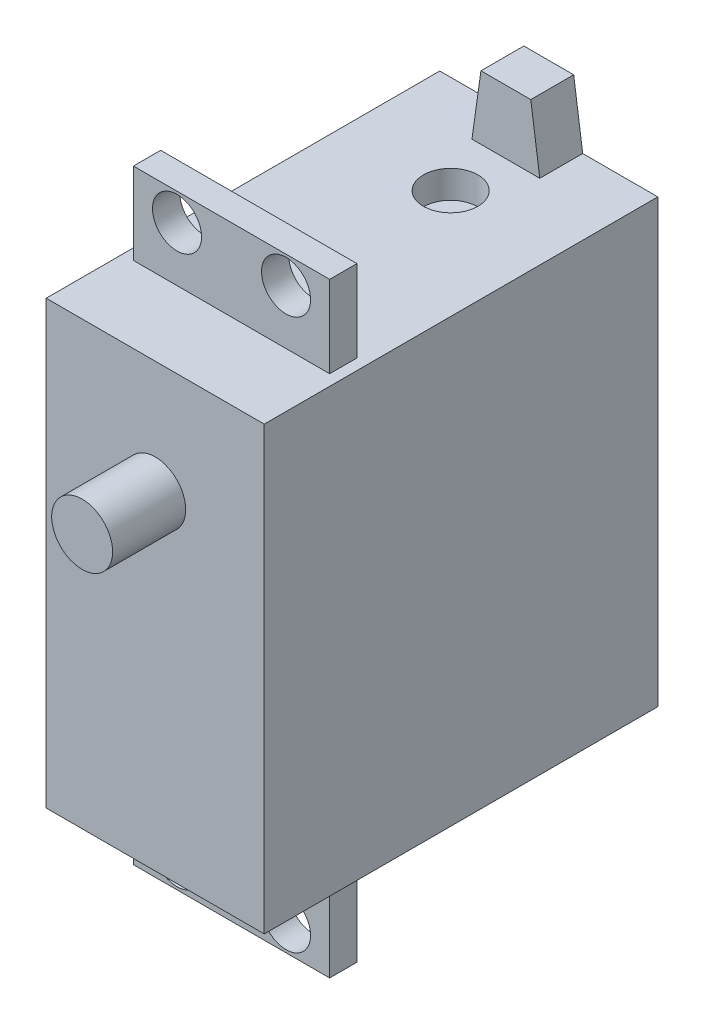
ISO-10303-21;
HEADER;
FILE_DESCRIPTION(('STEP AP214'),'2;1');
FILE_NAME('part.step','',(''),(''),'','','');
FILE_SCHEMA(('AUTOMOTIVE_DESIGN { 1 0 10303 214 1 1 1 1 }'));
ENDSEC;
DATA;
#1=APPLICATION_CONTEXT('core data for automotive mechanical design processes');
#2=APPLICATION_PROTOCOL_DEFINITION('international standard','automotive_design',2000,#1);
#3=PRODUCT_CONTEXT('',#1,'mechanical');
#4=PRODUCT('Part','Part','',(#3));
#5=PRODUCT_RELATED_PRODUCT_CATEGORY('part','',(#4));
#6=PRODUCT_DEFINITION_FORMATION('','',#4);
#7=PRODUCT_DEFINITION_CONTEXT('part definition',#1,'design');
#8=PRODUCT_DEFINITION('design','',#6,#7);
#9=PRODUCT_DEFINITION_SHAPE('','',#8);
#10=(LENGTH_UNIT() NAMED_UNIT(*) SI_UNIT(.MILLI.,.METRE.));
#11=(NAMED_UNIT(*) PLANE_ANGLE_UNIT() SI_UNIT($,.RADIAN.));
#12=(NAMED_UNIT(*) SI_UNIT($,.STERADIAN.) SOLID_ANGLE_UNIT());
#13=UNCERTAINTY_MEASURE_WITH_UNIT(LENGTH_MEASURE(1.E-05),#10,'distance_accuracy_value','');
#14=(GEOMETRIC_REPRESENTATION_CONTEXT(3) GLOBAL_UNCERTAINTY_ASSIGNED_CONTEXT((#13)) GLOBAL_UNIT_ASSIGNED_CONTEXT((#10,
#11,#12)) REPRESENTATION_CONTEXT('',''));
#15=CARTESIAN_POINT('',(0.,0.,0.));
#16=DIRECTION('',(0.,0.,1.));
#17=DIRECTION('',(1.,0.,0.));
#18=AXIS2_PLACEMENT_3D('',#15,#16,#17);
#19=CARTESIAN_POINT('',(0.,0.,9.50000005));
#20=DIRECTION('',(0.,0.,1.));
#21=DIRECTION('',(1.,0.,0.));
#22=AXIS2_PLACEMENT_3D('',#19,#20,#21);
#23=PLANE('',#22);
#24=DIRECTION('',(0.,-1.,0.));
#25=VECTOR('',#24,1.);
#26=CARTESIAN_POINT('',(0.,40.5,9.50000005));
#27=LINE('',#26,#25);
#28=CARTESIAN_POINT('',(0.,40.5,9.50000005));
#29=VERTEX_POINT('',#28);
#30=CARTESIAN_POINT('',(0.,0.,9.50000005));
#31=VERTEX_POINT('',#30);
#32=EDGE_CURVE('E280',#29,#31,#27,.T.);
#33=ORIENTED_EDGE('',*,*,#32,.T.);
#34=DIRECTION('',(1.,0.,0.));
#35=VECTOR('',#34,1.);
#36=CARTESIAN_POINT('',(0.,0.,9.50000005));
#37=LINE('',#36,#35);
#38=CARTESIAN_POINT('',(20.,0.,9.50000005));
#39=VERTEX_POINT('',#38);
#40=EDGE_CURVE('E283',#31,#39,#37,.T.);
#41=ORIENTED_EDGE('',*,*,#40,.T.);
#42=DIRECTION('',(0.,1.,0.));
#43=VECTOR('',#42,1.);
#44=CARTESIAN_POINT('',(20.,40.5,9.50000005));
#45=LINE('',#44,#43);
#46=CARTESIAN_POINT('',(20.,40.5,9.50000005));
#47=VERTEX_POINT('',#46);
#48=EDGE_CURVE('E285',#39,#47,#45,.T.);
#49=ORIENTED_EDGE('',*,*,#48,.T.);
#50=DIRECTION('',(-1.,0.,0.));
#51=VECTOR('',#50,1.);
#52=CARTESIAN_POINT('',(0.,40.5,9.50000005));
#53=LINE('',#52,#51);
#54=EDGE_CURVE('E287',#47,#29,#53,.T.);
#55=ORIENTED_EDGE('',*,*,#54,.T.);
#56=EDGE_LOOP('',(#33,#41,#49,#55));
#57=FACE_BOUND('',#56,.T.);
#58=CARTESIAN_POINT('',(10.,30.1,9.50000005));
#59=DIRECTION('',(0.,0.,1.));
#60=DIRECTION('',(1.,0.,0.));
#61=AXIS2_PLACEMENT_3D('',#58,#59,#60);
#62=CIRCLE('',#61,2.794);
#63=CARTESIAN_POINT('',(12.794,30.1,9.50000005));
#64=VERTEX_POINT('',#63);
#65=EDGE_CURVE('E183',#64,#64,#62,.T.);
#66=ORIENTED_EDGE('',*,*,#65,.F.);
#67=EDGE_LOOP('',(#66));
#68=FACE_BOUND('',#67,.T.);
#69=ADVANCED_FACE('F35',(#57,#68),#23,.T.);
#70=CARTESIAN_POINT('',(0.,40.5,9.50000005));
#71=DIRECTION('',(1.,0.,0.));
#72=DIRECTION('',(0.,1.,0.));
#73=AXIS2_PLACEMENT_3D('',#70,#71,#72);
#74=PLANE('',#73);
#75=DIRECTION('',(0.,0.,-1.));
#76=VECTOR('',#75,1.);
#77=CARTESIAN_POINT('',(0.,40.5,9.50000005));
#78=LINE('',#77,#76);
#79=CARTESIAN_POINT('',(0.,40.5,-26.60000005));
#80=VERTEX_POINT('',#79);
#81=EDGE_CURVE('E289',#29,#80,#78,.T.);
#82=ORIENTED_EDGE('',*,*,#81,.T.);
#83=DIRECTION('',(0.,1.,0.));
#84=VECTOR('',#83,1.);
#85=CARTESIAN_POINT('',(0.,40.5,-26.60000005));
#86=LINE('',#85,#84);
#87=CARTESIAN_POINT('',(0.,0.,-26.60000005));
#88=VERTEX_POINT('',#87);
#89=EDGE_CURVE('E274',#88,#80,#86,.T.);
#90=ORIENTED_EDGE('',*,*,#89,.F.);
#91=DIRECTION('',(0.,0.,-1.));
#92=VECTOR('',#91,1.);
#93=CARTESIAN_POINT('',(0.,0.,9.50000005));
#94=LINE('',#93,#92);
#95=EDGE_CURVE('E295',#31,#88,#94,.T.);
#96=ORIENTED_EDGE('',*,*,#95,.F.);
#97=ORIENTED_EDGE('',*,*,#32,.F.);
#98=EDGE_LOOP('',(#82,#90,#96,#97));
#99=FACE_BOUND('',#98,.T.);
#100=ADVANCED_FACE('F37',(#99),#74,.F.);
#101=CARTESIAN_POINT('',(0.,0.,9.50000005));
#102=DIRECTION('',(0.,1.,0.));
#103=DIRECTION('',(0.,0.,1.));
#104=AXIS2_PLACEMENT_3D('',#101,#102,#103);
#105=PLANE('',#104);
#106=DIRECTION('',(0.,0.,-1.));
#107=VECTOR('',#106,1.);
#108=CARTESIAN_POINT('',(1.,0.,2.5));
#109=LINE('',#108,#107);
#110=CARTESIAN_POINT('',(1.,0.,2.5));
#111=VERTEX_POINT('',#110);
#112=CARTESIAN_POINT('',(1.,0.,0.));
#113=VERTEX_POINT('',#112);
#114=EDGE_CURVE('E252',#111,#113,#109,.T.);
#115=ORIENTED_EDGE('',*,*,#114,.F.);
#116=DIRECTION('',(1.,0.,0.));
#117=VECTOR('',#116,1.);
#118=CARTESIAN_POINT('',(0.,0.,2.5));
#119=LINE('',#118,#117);
#120=CARTESIAN_POINT('',(19.,0.,2.5));
#121=VERTEX_POINT('',#120);
#122=EDGE_CURVE('E266',#111,#121,#119,.T.);
#123=ORIENTED_EDGE('',*,*,#122,.T.);
#124=DIRECTION('',(0.,0.,-1.));
#125=VECTOR('',#124,1.);
#126=CARTESIAN_POINT('',(19.,0.,2.5));
#127=LINE('',#126,#125);
#128=CARTESIAN_POINT('',(19.,0.,0.));
#129=VERTEX_POINT('',#128);
#130=EDGE_CURVE('E232',#121,#129,#127,.T.);
#131=ORIENTED_EDGE('',*,*,#130,.T.);
#132=DIRECTION('',(1.,0.,0.));
#133=VECTOR('',#132,1.);
#134=CARTESIAN_POINT('',(0.,0.,0.));
#135=LINE('',#134,#133);
#136=EDGE_CURVE('E58',#113,#129,#135,.T.);
#137=ORIENTED_EDGE('',*,*,#136,.F.);
#138=EDGE_LOOP('',(#115,#123,#131,#137));
#139=FACE_BOUND('',#138,.T.);
#140=ORIENTED_EDGE('',*,*,#95,.T.);
#141=DIRECTION('',(-1.,0.,0.));
#142=VECTOR('',#141,1.);
#143=CARTESIAN_POINT('',(20.,0.,-26.60000005));
#144=LINE('',#143,#142);
#145=CARTESIAN_POINT('',(20.,0.,-26.60000005));
#146=VERTEX_POINT('',#145);
#147=EDGE_CURVE('E271',#146,#88,#144,.T.);
#148=ORIENTED_EDGE('',*,*,#147,.F.);
#149=DIRECTION('',(0.,0.,-1.));
#150=VECTOR('',#149,1.);
#151=CARTESIAN_POINT('',(20.,0.,9.50000005));
#152=LINE('',#151,#150);
#153=EDGE_CURVE('E293',#39,#146,#152,.T.);
#154=ORIENTED_EDGE('',*,*,#153,.F.);
#155=ORIENTED_EDGE('',*,*,#40,.F.);
#156=EDGE_LOOP('',(#140,#148,#154,#155));
#157=FACE_BOUND('',#156,.T.);
#158=ADVANCED_FACE('F339',(#139,#157),#105,.F.);
#159=CARTESIAN_POINT('',(20.,40.5,9.50000005));
#160=DIRECTION('',(-1.,0.,0.));
#161=DIRECTION('',(0.,0.,1.));
#162=AXIS2_PLACEMENT_3D('',#159,#160,#161);
#163=PLANE('',#162);
#164=ORIENTED_EDGE('',*,*,#153,.T.);
#165=DIRECTION('',(0.,-1.,0.));
#166=VECTOR('',#165,1.);
#167=CARTESIAN_POINT('',(20.,40.5,-26.60000005));
#168=LINE('',#167,#166);
#169=CARTESIAN_POINT('',(20.,40.5,-26.60000005));
#170=VERTEX_POINT('',#169);
#171=EDGE_CURVE('E268',#170,#146,#168,.T.);
#172=ORIENTED_EDGE('',*,*,#171,.F.);
#173=DIRECTION('',(0.,0.,-1.));
#174=VECTOR('',#173,1.);
#175=CARTESIAN_POINT('',(20.,40.5,9.50000005));
#176=LINE('',#175,#174);
#177=EDGE_CURVE('E291',#47,#170,#176,.T.);
#178=ORIENTED_EDGE('',*,*,#177,.F.);
#179=ORIENTED_EDGE('',*,*,#48,.F.);
#180=EDGE_LOOP('',(#164,#172,#178,#179));
#181=FACE_BOUND('',#180,.T.);
#182=ADVANCED_FACE('F348',(#181),#163,.F.);
#183=CARTESIAN_POINT('',(0.,40.5,9.50000005));
#184=DIRECTION('',(0.,-1.,0.));
#185=DIRECTION('',(1.,0.,0.));
#186=AXIS2_PLACEMENT_3D('',#183,#184,#185);
#187=PLANE('',#186);
#188=DIRECTION('',(1.,0.,0.));
#189=VECTOR('',#188,1.);
#190=CARTESIAN_POINT('',(20.,40.5,-26.60000005));
#191=LINE('',#190,#189);
#192=CARTESIAN_POINT('',(13.1115,40.5,-26.60000005));
#193=VERTEX_POINT('',#192);
#194=EDGE_CURVE('E171',#193,#170,#191,.T.);
#195=ORIENTED_EDGE('',*,*,#194,.F.);
#196=DIRECTION('',(0.,0.,-1.));
#197=VECTOR('',#196,1.);
#198=CARTESIAN_POINT('',(13.1115,40.5,-22.66300005));
#199=LINE('',#198,#197);
#200=CARTESIAN_POINT('',(13.1115,40.5,-22.66300005));
#201=VERTEX_POINT('',#200);
#202=EDGE_CURVE('E163',#201,#193,#199,.T.);
#203=ORIENTED_EDGE('',*,*,#202,.F.);
#204=DIRECTION('',(-1.,0.,0.));
#205=VECTOR('',#204,1.);
#206=CARTESIAN_POINT('',(13.1115,40.5,-22.66300005));
#207=LINE('',#206,#205);
#208=CARTESIAN_POINT('',(6.8885,40.5,-22.66300005));
#209=VERTEX_POINT('',#208);
#210=EDGE_CURVE('E149',#201,#209,#207,.T.);
#211=ORIENTED_EDGE('',*,*,#210,.T.);
#212=DIRECTION('',(0.,0.,-1.));
#213=VECTOR('',#212,1.);
#214=CARTESIAN_POINT('',(6.8885,40.5,-22.66300005));
#215=LINE('',#214,#213);
#216=CARTESIAN_POINT('',(6.8885,40.5,-26.60000005));
#217=VERTEX_POINT('',#216);
#218=EDGE_CURVE('E172',#209,#217,#215,.T.);
#219=ORIENTED_EDGE('',*,*,#218,.T.);
#220=EDGE_CURVE('E277',#80,#217,#191,.T.);
#221=ORIENTED_EDGE('',*,*,#220,.F.);
#222=ORIENTED_EDGE('',*,*,#81,.F.);
#223=ORIENTED_EDGE('',*,*,#54,.F.);
#224=ORIENTED_EDGE('',*,*,#177,.T.);
#225=EDGE_LOOP('',(#195,#203,#211,#219,#221,#222,#223,#224));
#226=FACE_BOUND('',#225,.T.);
#227=CARTESIAN_POINT('',(10.,40.5,-17.60000005));
#228=DIRECTION('',(0.,1.,0.));
#229=DIRECTION('',(-1.,0.,0.));
#230=AXIS2_PLACEMENT_3D('',#227,#228,#229);
#231=CIRCLE('',#230,2.5);
#232=CARTESIAN_POINT('',(7.5,40.5,-17.60000005));
#233=VERTEX_POINT('',#232);
#234=EDGE_CURVE('E184',#233,#233,#231,.T.);
#235=ORIENTED_EDGE('',*,*,#234,.F.);
#236=EDGE_LOOP('',(#235));
#237=FACE_BOUND('',#236,.T.);
#238=DIRECTION('',(0.,0.,-1.));
#239=VECTOR('',#238,1.);
#240=CARTESIAN_POINT('',(19.,40.5,2.5));
#241=LINE('',#240,#239);
#242=CARTESIAN_POINT('',(19.,40.5,2.5));
#243=VERTEX_POINT('',#242);
#244=CARTESIAN_POINT('',(19.,40.5,0.));
#245=VERTEX_POINT('',#244);
#246=EDGE_CURVE('E262',#243,#245,#241,.T.);
#247=ORIENTED_EDGE('',*,*,#246,.F.);
#248=DIRECTION('',(-1.,0.,0.));
#249=VECTOR('',#248,1.);
#250=CARTESIAN_POINT('',(0.,40.5,2.5));
#251=LINE('',#250,#249);
#252=CARTESIAN_POINT('',(0.999999999999999,40.5,2.5));
#253=VERTEX_POINT('',#252);
#254=EDGE_CURVE('E11',#243,#253,#251,.T.);
#255=ORIENTED_EDGE('',*,*,#254,.T.);
#256=DIRECTION('',(0.,0.,-1.));
#257=VECTOR('',#256,1.);
#258=CARTESIAN_POINT('',(0.999999999999999,40.5,2.5));
#259=LINE('',#258,#257);
#260=CARTESIAN_POINT('',(0.999999999999999,40.5,0.));
#261=VERTEX_POINT('',#260);
#262=EDGE_CURVE('E254',#253,#261,#259,.T.);
#263=ORIENTED_EDGE('',*,*,#262,.T.);
#264=DIRECTION('',(-1.,0.,0.));
#265=VECTOR('',#264,1.);
#266=CARTESIAN_POINT('',(0.,40.5,0.));
#267=LINE('',#266,#265);
#268=EDGE_CURVE('E43',#245,#261,#267,.T.);
#269=ORIENTED_EDGE('',*,*,#268,.F.);
#270=EDGE_LOOP('',(#247,#255,#263,#269));
#271=FACE_BOUND('',#270,.T.);
#272=ADVANCED_FACE('F168',(#226,#237,#271),#187,.F.);
#273=CARTESIAN_POINT('',(0.,0.,-26.60000005));
#274=DIRECTION('',(0.,0.,-1.));
#275=DIRECTION('',(-1.,0.,0.));
#276=AXIS2_PLACEMENT_3D('',#273,#274,#275);
#277=PLANE('',#276);
#278=ORIENTED_EDGE('',*,*,#171,.T.);
#279=ORIENTED_EDGE('',*,*,#147,.T.);
#280=ORIENTED_EDGE('',*,*,#89,.T.);
#281=ORIENTED_EDGE('',*,*,#220,.T.);
#282=DIRECTION('',(0.139914421726849,0.990163599913086,0.));
#283=VECTOR('',#282,1.);
#284=CARTESIAN_POINT('',(6.8885,40.5,-26.60000005));
#285=LINE('',#284,#283);
#286=CARTESIAN_POINT('',(7.714,46.342,-26.60000005));
#287=VERTEX_POINT('',#286);
#288=EDGE_CURVE('E366',#217,#287,#285,.T.);
#289=ORIENTED_EDGE('',*,*,#288,.T.);
#290=DIRECTION('',(1.,0.,0.));
#291=VECTOR('',#290,1.);
#292=CARTESIAN_POINT('',(12.286,46.342,-26.60000005));
#293=LINE('',#292,#291);
#294=CARTESIAN_POINT('',(12.286,46.342,-26.60000005));
#295=VERTEX_POINT('',#294);
#296=EDGE_CURVE('E166',#287,#295,#293,.T.);
#297=ORIENTED_EDGE('',*,*,#296,.T.);
#298=DIRECTION('',(0.139914421726849,-0.990163599913086,0.));
#299=VECTOR('',#298,1.);
#300=CARTESIAN_POINT('',(13.1115,40.5,-26.60000005));
#301=LINE('',#300,#299);
#302=EDGE_CURVE('E50',#295,#193,#301,.T.);
#303=ORIENTED_EDGE('',*,*,#302,.T.);
#304=ORIENTED_EDGE('',*,*,#194,.T.);
#305=EDGE_LOOP('',(#278,#279,#280,#281,#289,#297,#303,#304));
#306=FACE_BOUND('',#305,.T.);
#307=ADVANCED_FACE('F344',(#306),#277,.T.);
#308=CARTESIAN_POINT('',(5.,45.5,2.5));
#309=DIRECTION('',(0.,0.,-1.));
#310=DIRECTION('',(-1.,0.,0.));
#311=AXIS2_PLACEMENT_3D('',#308,#309,#310);
#312=CYLINDRICAL_SURFACE('',#311,2.25);
#313=CARTESIAN_POINT('',(5.,45.5,2.5));
#314=DIRECTION('',(0.,0.,1.));
#315=DIRECTION('',(1.,0.,0.));
#316=AXIS2_PLACEMENT_3D('',#313,#314,#315);
#317=CIRCLE('',#316,2.25);
#318=CARTESIAN_POINT('',(7.25,45.5,2.5));
#319=VERTEX_POINT('',#318);
#320=EDGE_CURVE('E199',#319,#319,#317,.T.);
#321=ORIENTED_EDGE('',*,*,#320,.T.);
#322=EDGE_LOOP('',(#321));
#323=FACE_BOUND('',#322,.T.);
#324=CARTESIAN_POINT('',(5.,45.5,0.));
#325=DIRECTION('',(0.,0.,1.));
#326=DIRECTION('',(1.,0.,0.));
#327=AXIS2_PLACEMENT_3D('',#324,#325,#326);
#328=CIRCLE('',#327,2.25);
#329=CARTESIAN_POINT('',(7.25,45.5,0.));
#330=VERTEX_POINT('',#329);
#331=EDGE_CURVE('E196',#330,#330,#328,.T.);
#332=ORIENTED_EDGE('',*,*,#331,.F.);
#333=EDGE_LOOP('',(#332));
#334=FACE_BOUND('',#333,.T.);
#335=ADVANCED_FACE('F408',(#323,#334),#312,.F.);
#336=CARTESIAN_POINT('',(15.,45.5,2.5));
#337=DIRECTION('',(0.,0.,-1.));
#338=DIRECTION('',(-1.,0.,0.));
#339=AXIS2_PLACEMENT_3D('',#336,#337,#338);
#340=CYLINDRICAL_SURFACE('',#339,2.25);
#341=CARTESIAN_POINT('',(15.,45.5,2.5));
#342=DIRECTION('',(0.,0.,1.));
#343=DIRECTION('',(1.,0.,0.));
#344=AXIS2_PLACEMENT_3D('',#341,#342,#343);
#345=CIRCLE('',#344,2.25);
#346=CARTESIAN_POINT('',(17.25,45.5,2.5));
#347=VERTEX_POINT('',#346);
#348=EDGE_CURVE('E193',#347,#347,#345,.T.);
#349=ORIENTED_EDGE('',*,*,#348,.T.);
#350=EDGE_LOOP('',(#349));
#351=FACE_BOUND('',#350,.T.);
#352=CARTESIAN_POINT('',(15.,45.5,0.));
#353=DIRECTION('',(0.,0.,1.));
#354=DIRECTION('',(1.,0.,0.));
#355=AXIS2_PLACEMENT_3D('',#352,#353,#354);
#356=CIRCLE('',#355,2.25);
#357=CARTESIAN_POINT('',(17.25,45.5,0.));
#358=VERTEX_POINT('',#357);
#359=EDGE_CURVE('E190',#358,#358,#356,.T.);
#360=ORIENTED_EDGE('',*,*,#359,.F.);
#361=EDGE_LOOP('',(#360));
#362=FACE_BOUND('',#361,.T.);
#363=ADVANCED_FACE('F405',(#351,#362),#340,.F.);
#364=CARTESIAN_POINT('',(0.999999999999997,48.,2.5));
#365=DIRECTION('',(0.,-1.,0.));
#366=DIRECTION('',(1.,0.,0.));
#367=AXIS2_PLACEMENT_3D('',#364,#365,#366);
#368=PLANE('',#367);
#369=DIRECTION('',(-1.,0.,0.));
#370=VECTOR('',#369,1.);
#371=CARTESIAN_POINT('',(0.999999999999997,48.,0.));
#372=LINE('',#371,#370);
#373=CARTESIAN_POINT('',(19.,48.,0.));
#374=VERTEX_POINT('',#373);
#375=CARTESIAN_POINT('',(0.999999999999997,48.,0.));
#376=VERTEX_POINT('',#375);
#377=EDGE_CURVE('E234',#374,#376,#372,.T.);
#378=ORIENTED_EDGE('',*,*,#377,.T.);
#379=DIRECTION('',(0.,0.,-1.));
#380=VECTOR('',#379,1.);
#381=CARTESIAN_POINT('',(0.999999999999997,48.,2.5));
#382=LINE('',#381,#380);
#383=CARTESIAN_POINT('',(0.999999999999997,48.,2.5));
#384=VERTEX_POINT('',#383);
#385=EDGE_CURVE('E256',#384,#376,#382,.T.);
#386=ORIENTED_EDGE('',*,*,#385,.F.);
#387=DIRECTION('',(-1.,0.,0.));
#388=VECTOR('',#387,1.);
#389=CARTESIAN_POINT('',(0.999999999999997,48.,2.5));
#390=LINE('',#389,#388);
#391=CARTESIAN_POINT('',(19.,48.,2.5));
#392=VERTEX_POINT('',#391);
#393=EDGE_CURVE('E219',#392,#384,#390,.T.);
#394=ORIENTED_EDGE('',*,*,#393,.F.);
#395=DIRECTION('',(0.,0.,-1.));
#396=VECTOR('',#395,1.);
#397=CARTESIAN_POINT('',(19.,48.,2.5));
#398=LINE('',#397,#396);
#399=EDGE_CURVE('E259',#392,#374,#398,.T.);
#400=ORIENTED_EDGE('',*,*,#399,.T.);
#401=EDGE_LOOP('',(#378,#386,#394,#400));
#402=FACE_BOUND('',#401,.T.);
#403=ADVANCED_FACE('F310',(#402),#368,.F.);
#404=CARTESIAN_POINT('',(0.999999999999997,48.,2.5));
#405=DIRECTION('',(1.,0.,0.));
#406=DIRECTION('',(0.,1.,0.));
#407=AXIS2_PLACEMENT_3D('',#404,#405,#406);
#408=PLANE('',#407);
#409=DIRECTION('',(0.,-1.,0.));
#410=VECTOR('',#409,1.);
#411=CARTESIAN_POINT('',(0.999999999999997,48.,0.));
#412=LINE('',#411,#410);
#413=EDGE_CURVE('E236',#376,#261,#412,.T.);
#414=ORIENTED_EDGE('',*,*,#413,.T.);
#415=ORIENTED_EDGE('',*,*,#262,.F.);
#416=DIRECTION('',(0.,-1.,0.));
#417=VECTOR('',#416,1.);
#418=CARTESIAN_POINT('',(0.999999999999997,48.,2.5));
#419=LINE('',#418,#417);
#420=EDGE_CURVE('E222',#384,#253,#419,.T.);
#421=ORIENTED_EDGE('',*,*,#420,.F.);
#422=ORIENTED_EDGE('',*,*,#385,.T.);
#423=EDGE_LOOP('',(#414,#415,#421,#422));
#424=FACE_BOUND('',#423,.T.);
#425=ADVANCED_FACE('F305',(#424),#408,.F.);
#426=CARTESIAN_POINT('',(19.,48.,2.5));
#427=DIRECTION('',(-1.,0.,0.));
#428=DIRECTION('',(0.,-1.,0.));
#429=AXIS2_PLACEMENT_3D('',#426,#427,#428);
#430=PLANE('',#429);
#431=DIRECTION('',(0.,1.,0.));
#432=VECTOR('',#431,1.);
#433=CARTESIAN_POINT('',(19.,48.,0.));
#434=LINE('',#433,#432);
#435=EDGE_CURVE('E214',#245,#374,#434,.T.);
#436=ORIENTED_EDGE('',*,*,#435,.T.);
#437=ORIENTED_EDGE('',*,*,#399,.F.);
#438=DIRECTION('',(0.,1.,0.));
#439=VECTOR('',#438,1.);
#440=CARTESIAN_POINT('',(19.,48.,2.5));
#441=LINE('',#440,#439);
#442=EDGE_CURVE('E217',#243,#392,#441,.T.);
#443=ORIENTED_EDGE('',*,*,#442,.F.);
#444=ORIENTED_EDGE('',*,*,#246,.T.);
#445=EDGE_LOOP('',(#436,#437,#443,#444));
#446=FACE_BOUND('',#445,.T.);
#447=ADVANCED_FACE('F314',(#446),#430,.F.);
#448=CARTESIAN_POINT('',(0.,0.,0.));
#449=DIRECTION('',(0.,0.,1.));
#450=DIRECTION('',(1.,0.,0.));
#451=AXIS2_PLACEMENT_3D('',#448,#449,#450);
#452=PLANE('',#451);
#453=ORIENTED_EDGE('',*,*,#359,.T.);
#454=EDGE_LOOP('',(#453));
#455=FACE_BOUND('',#454,.T.);
#456=ORIENTED_EDGE('',*,*,#331,.T.);
#457=EDGE_LOOP('',(#456));
#458=FACE_BOUND('',#457,.T.);
#459=ORIENTED_EDGE('',*,*,#435,.F.);
#460=ORIENTED_EDGE('',*,*,#268,.T.);
#461=ORIENTED_EDGE('',*,*,#413,.F.);
#462=ORIENTED_EDGE('',*,*,#377,.F.);
#463=EDGE_LOOP('',(#459,#460,#461,#462));
#464=FACE_BOUND('',#463,.T.);
#465=ADVANCED_FACE('F300',(#455,#458,#464),#452,.F.);
#466=CARTESIAN_POINT('',(0.,0.,2.5));
#467=DIRECTION('',(0.,0.,1.));
#468=DIRECTION('',(1.,0.,0.));
#469=AXIS2_PLACEMENT_3D('',#466,#467,#468);
#470=PLANE('',#469);
#471=ORIENTED_EDGE('',*,*,#348,.F.);
#472=EDGE_LOOP('',(#471));
#473=FACE_BOUND('',#472,.T.);
#474=ORIENTED_EDGE('',*,*,#320,.F.);
#475=EDGE_LOOP('',(#474));
#476=FACE_BOUND('',#475,.T.);
#477=ORIENTED_EDGE('',*,*,#254,.F.);
#478=ORIENTED_EDGE('',*,*,#442,.T.);
#479=ORIENTED_EDGE('',*,*,#393,.T.);
#480=ORIENTED_EDGE('',*,*,#420,.T.);
#481=EDGE_LOOP('',(#477,#478,#479,#480));
#482=FACE_BOUND('',#481,.T.);
#483=ADVANCED_FACE('F317',(#473,#476,#482),#470,.T.);
#484=CARTESIAN_POINT('',(15.,-5.,2.5));
#485=DIRECTION('',(0.,0.,1.));
#486=DIRECTION('',(1.,0.,0.));
#487=AXIS2_PLACEMENT_3D('',#484,#485,#486);
#488=CIRCLE('',#487,2.25);
#489=CARTESIAN_POINT('',(17.25,-5.,2.5));
#490=VERTEX_POINT('',#489);
#491=EDGE_CURVE('E205',#490,#490,#488,.T.);
#492=ORIENTED_EDGE('',*,*,#491,.F.);
#493=EDGE_LOOP('',(#492));
#494=FACE_BOUND('',#493,.T.);
#495=CARTESIAN_POINT('',(5.,-5.,2.5));
#496=DIRECTION('',(0.,0.,1.));
#497=DIRECTION('',(1.,0.,0.));
#498=AXIS2_PLACEMENT_3D('',#495,#496,#497);
#499=CIRCLE('',#498,2.25);
#500=CARTESIAN_POINT('',(7.25,-5.,2.5));
#501=VERTEX_POINT('',#500);
#502=EDGE_CURVE('E211',#501,#501,#499,.T.);
#503=ORIENTED_EDGE('',*,*,#502,.F.);
#504=EDGE_LOOP('',(#503));
#505=FACE_BOUND('',#504,.T.);
#506=ORIENTED_EDGE('',*,*,#122,.F.);
#507=DIRECTION('',(0.,-1.,0.));
#508=VECTOR('',#507,1.);
#509=CARTESIAN_POINT('',(1.,0.,2.5));
#510=LINE('',#509,#508);
#511=CARTESIAN_POINT('',(1.00000000000002,-7.5,2.5));
#512=VERTEX_POINT('',#511);
#513=EDGE_CURVE('E225',#111,#512,#510,.T.);
#514=ORIENTED_EDGE('',*,*,#513,.T.);
#515=DIRECTION('',(1.,0.,0.));
#516=VECTOR('',#515,1.);
#517=CARTESIAN_POINT('',(1.00000000000002,-7.5,2.5));
#518=LINE('',#517,#516);
#519=CARTESIAN_POINT('',(19.,-7.5,2.5));
#520=VERTEX_POINT('',#519);
#521=EDGE_CURVE('E227',#512,#520,#518,.T.);
#522=ORIENTED_EDGE('',*,*,#521,.T.);
#523=DIRECTION('',(0.,1.,0.));
#524=VECTOR('',#523,1.);
#525=CARTESIAN_POINT('',(19.,0.,2.5));
#526=LINE('',#525,#524);
#527=EDGE_CURVE('E229',#520,#121,#526,.T.);
#528=ORIENTED_EDGE('',*,*,#527,.T.);
#529=EDGE_LOOP('',(#506,#514,#522,#528));
#530=FACE_BOUND('',#529,.T.);
#531=ADVANCED_FACE('F319',(#494,#505,#530),#470,.T.);
#532=CARTESIAN_POINT('',(15.,-5.,0.));
#533=DIRECTION('',(0.,0.,1.));
#534=DIRECTION('',(1.,0.,0.));
#535=AXIS2_PLACEMENT_3D('',#532,#533,#534);
#536=CIRCLE('',#535,2.25);
#537=CARTESIAN_POINT('',(17.25,-5.,0.));
#538=VERTEX_POINT('',#537);
#539=EDGE_CURVE('E202',#538,#538,#536,.T.);
#540=ORIENTED_EDGE('',*,*,#539,.T.);
#541=EDGE_LOOP('',(#540));
#542=FACE_BOUND('',#541,.T.);
#543=CARTESIAN_POINT('',(5.,-5.,0.));
#544=DIRECTION('',(0.,0.,1.));
#545=DIRECTION('',(1.,0.,0.));
#546=AXIS2_PLACEMENT_3D('',#543,#544,#545);
#547=CIRCLE('',#546,2.25);
#548=CARTESIAN_POINT('',(7.25,-5.,0.));
#549=VERTEX_POINT('',#548);
#550=EDGE_CURVE('E208',#549,#549,#547,.T.);
#551=ORIENTED_EDGE('',*,*,#550,.T.);
#552=EDGE_LOOP('',(#551));
#553=FACE_BOUND('',#552,.T.);
#554=DIRECTION('',(0.,-1.,0.));
#555=VECTOR('',#554,1.);
#556=CARTESIAN_POINT('',(1.,0.,0.));
#557=LINE('',#556,#555);
#558=CARTESIAN_POINT('',(1.00000000000002,-7.5,0.));
#559=VERTEX_POINT('',#558);
#560=EDGE_CURVE('E239',#113,#559,#557,.T.);
#561=ORIENTED_EDGE('',*,*,#560,.F.);
#562=ORIENTED_EDGE('',*,*,#136,.T.);
#563=DIRECTION('',(0.,1.,0.));
#564=VECTOR('',#563,1.);
#565=CARTESIAN_POINT('',(19.,0.,0.));
#566=LINE('',#565,#564);
#567=CARTESIAN_POINT('',(19.,-7.5,0.));
#568=VERTEX_POINT('',#567);
#569=EDGE_CURVE('E220',#568,#129,#566,.T.);
#570=ORIENTED_EDGE('',*,*,#569,.F.);
#571=DIRECTION('',(1.,0.,0.));
#572=VECTOR('',#571,1.);
#573=CARTESIAN_POINT('',(1.00000000000002,-7.5,0.));
#574=LINE('',#573,#572);
#575=EDGE_CURVE('E241',#559,#568,#574,.T.);
#576=ORIENTED_EDGE('',*,*,#575,.F.);
#577=EDGE_LOOP('',(#561,#562,#570,#576));
#578=FACE_BOUND('',#577,.T.);
#579=ADVANCED_FACE('F326',(#542,#553,#578),#452,.F.);
#580=CARTESIAN_POINT('',(1.,0.,2.5));
#581=DIRECTION('',(1.,0.,0.));
#582=DIRECTION('',(0.,1.,0.));
#583=AXIS2_PLACEMENT_3D('',#580,#581,#582);
#584=PLANE('',#583);
#585=ORIENTED_EDGE('',*,*,#560,.T.);
#586=DIRECTION('',(0.,0.,-1.));
#587=VECTOR('',#586,1.);
#588=CARTESIAN_POINT('',(1.00000000000002,-7.5,2.5));
#589=LINE('',#588,#587);
#590=EDGE_CURVE('E249',#512,#559,#589,.T.);
#591=ORIENTED_EDGE('',*,*,#590,.F.);
#592=ORIENTED_EDGE('',*,*,#513,.F.);
#593=ORIENTED_EDGE('',*,*,#114,.T.);
#594=EDGE_LOOP('',(#585,#591,#592,#593));
#595=FACE_BOUND('',#594,.T.);
#596=ADVANCED_FACE('F431',(#595),#584,.F.);
#597=CARTESIAN_POINT('',(1.00000000000002,-7.5,2.5));
#598=DIRECTION('',(0.,1.,0.));
#599=DIRECTION('',(-1.,0.,0.));
#600=AXIS2_PLACEMENT_3D('',#597,#598,#599);
#601=PLANE('',#600);
#602=ORIENTED_EDGE('',*,*,#575,.T.);
#603=DIRECTION('',(0.,0.,-1.));
#604=VECTOR('',#603,1.);
#605=CARTESIAN_POINT('',(19.,-7.5,2.5));
#606=LINE('',#605,#604);
#607=EDGE_CURVE('E246',#520,#568,#606,.T.);
#608=ORIENTED_EDGE('',*,*,#607,.F.);
#609=ORIENTED_EDGE('',*,*,#521,.F.);
#610=ORIENTED_EDGE('',*,*,#590,.T.);
#611=EDGE_LOOP('',(#602,#608,#609,#610));
#612=FACE_BOUND('',#611,.T.);
#613=ADVANCED_FACE('F422',(#612),#601,.F.);
#614=CARTESIAN_POINT('',(19.,0.,2.5));
#615=DIRECTION('',(-1.,0.,0.));
#616=DIRECTION('',(0.,-1.,0.));
#617=AXIS2_PLACEMENT_3D('',#614,#615,#616);
#618=PLANE('',#617);
#619=ORIENTED_EDGE('',*,*,#569,.T.);
#620=ORIENTED_EDGE('',*,*,#130,.F.);
#621=ORIENTED_EDGE('',*,*,#527,.F.);
#622=ORIENTED_EDGE('',*,*,#607,.T.);
#623=EDGE_LOOP('',(#619,#620,#621,#622));
#624=FACE_BOUND('',#623,.T.);
#625=ADVANCED_FACE('F417',(#624),#618,.F.);
#626=CARTESIAN_POINT('',(5.,-5.,2.5));
#627=DIRECTION('',(0.,0.,-1.));
#628=DIRECTION('',(-1.,0.,0.));
#629=AXIS2_PLACEMENT_3D('',#626,#627,#628);
#630=CYLINDRICAL_SURFACE('',#629,2.25);
#631=ORIENTED_EDGE('',*,*,#502,.T.);
#632=EDGE_LOOP('',(#631));
#633=FACE_BOUND('',#632,.T.);
#634=ORIENTED_EDGE('',*,*,#550,.F.);
#635=EDGE_LOOP('',(#634));
#636=FACE_BOUND('',#635,.T.);
#637=ADVANCED_FACE('F414',(#633,#636),#630,.F.);
#638=CARTESIAN_POINT('',(15.,-5.,2.5));
#639=DIRECTION('',(0.,0.,-1.));
#640=DIRECTION('',(-1.,0.,0.));
#641=AXIS2_PLACEMENT_3D('',#638,#639,#640);
#642=CYLINDRICAL_SURFACE('',#641,2.25);
#643=ORIENTED_EDGE('',*,*,#491,.T.);
#644=EDGE_LOOP('',(#643));
#645=FACE_BOUND('',#644,.T.);
#646=ORIENTED_EDGE('',*,*,#539,.F.);
#647=EDGE_LOOP('',(#646));
#648=FACE_BOUND('',#647,.T.);
#649=ADVANCED_FACE('F403',(#645,#648),#642,.F.);
#650=CARTESIAN_POINT('',(10.,30.1,16.202060052));
#651=DIRECTION('',(0.,0.,-1.));
#652=DIRECTION('',(-1.,0.,0.));
#653=AXIS2_PLACEMENT_3D('',#650,#651,#652);
#654=CYLINDRICAL_SURFACE('',#653,2.794);
#655=CARTESIAN_POINT('',(10.,30.1,16.202060052));
#656=DIRECTION('',(0.,0.,1.));
#657=DIRECTION('',(1.,0.,0.));
#658=AXIS2_PLACEMENT_3D('',#655,#656,#657);
#659=CIRCLE('',#658,2.794);
#660=CARTESIAN_POINT('',(12.794,30.1,16.202060052));
#661=VERTEX_POINT('',#660);
#662=EDGE_CURVE('E187',#661,#661,#659,.T.);
#663=ORIENTED_EDGE('',*,*,#662,.F.);
#664=EDGE_LOOP('',(#663));
#665=FACE_BOUND('',#664,.T.);
#666=ORIENTED_EDGE('',*,*,#65,.T.);
#667=EDGE_LOOP('',(#666));
#668=FACE_BOUND('',#667,.T.);
#669=ADVANCED_FACE('F399',(#665,#668),#654,.T.);
#670=CARTESIAN_POINT('',(10.,30.1,16.202060052));
#671=DIRECTION('',(0.,0.,1.));
#672=DIRECTION('',(1.,0.,0.));
#673=AXIS2_PLACEMENT_3D('',#670,#671,#672);
#674=PLANE('',#673);
#675=ORIENTED_EDGE('',*,*,#662,.T.);
#676=EDGE_LOOP('',(#675));
#677=FACE_BOUND('',#676,.T.);
#678=ADVANCED_FACE('F395',(#677),#674,.T.);
#679=CARTESIAN_POINT('',(10.,37.96,-17.60000005));
#680=DIRECTION('',(0.,1.,0.));
#681=DIRECTION('',(-1.,0.,0.));
#682=AXIS2_PLACEMENT_3D('',#679,#680,#681);
#683=CYLINDRICAL_SURFACE('',#682,2.5);
#684=CARTESIAN_POINT('',(10.,37.96,-17.60000005));
#685=DIRECTION('',(0.,1.,0.));
#686=DIRECTION('',(-1.,0.,0.));
#687=AXIS2_PLACEMENT_3D('',#684,#685,#686);
#688=CIRCLE('',#687,2.5);
#689=CARTESIAN_POINT('',(7.5,37.96,-17.60000005));
#690=VERTEX_POINT('',#689);
#691=EDGE_CURVE('E180',#690,#690,#688,.T.);
#692=ORIENTED_EDGE('',*,*,#691,.F.);
#693=EDGE_LOOP('',(#692));
#694=FACE_BOUND('',#693,.T.);
#695=ORIENTED_EDGE('',*,*,#234,.T.);
#696=EDGE_LOOP('',(#695));
#697=FACE_BOUND('',#696,.T.);
#698=ADVANCED_FACE('F391',(#694,#697),#683,.F.);
#699=CARTESIAN_POINT('',(10.,37.96,-17.60000005));
#700=DIRECTION('',(0.,1.,0.));
#701=DIRECTION('',(-1.,0.,0.));
#702=AXIS2_PLACEMENT_3D('',#699,#700,#701);
#703=PLANE('',#702);
#704=ORIENTED_EDGE('',*,*,#691,.T.);
#705=EDGE_LOOP('',(#704));
#706=FACE_BOUND('',#705,.T.);
#707=ADVANCED_FACE('F388',(#706),#703,.T.);
#708=CARTESIAN_POINT('',(13.1115,40.5,-22.66300005));
#709=DIRECTION('',(0.990163599913086,0.139914421726849,0.));
#710=DIRECTION('',(-0.139914421726849,0.990163599913086,0.));
#711=AXIS2_PLACEMENT_3D('',#708,#709,#710);
#712=PLANE('',#711);
#713=ORIENTED_EDGE('',*,*,#302,.F.);
#714=DIRECTION('',(0.,0.,-1.));
#715=VECTOR('',#714,1.);
#716=CARTESIAN_POINT('',(12.286,46.342,-22.66300005));
#717=LINE('',#716,#715);
#718=CARTESIAN_POINT('',(12.286,46.342,-22.66300005));
#719=VERTEX_POINT('',#718);
#720=EDGE_CURVE('E165',#719,#295,#717,.T.);
#721=ORIENTED_EDGE('',*,*,#720,.F.);
#722=DIRECTION('',(0.139914421726849,-0.990163599913086,0.));
#723=VECTOR('',#722,1.);
#724=CARTESIAN_POINT('',(13.1115,40.5,-22.66300005));
#725=LINE('',#724,#723);
#726=EDGE_CURVE('E153',#719,#201,#725,.T.);
#727=ORIENTED_EDGE('',*,*,#726,.T.);
#728=ORIENTED_EDGE('',*,*,#202,.T.);
#729=EDGE_LOOP('',(#713,#721,#727,#728));
#730=FACE_BOUND('',#729,.T.);
#731=ADVANCED_FACE('F162',(#730),#712,.T.);
#732=CARTESIAN_POINT('',(12.286,46.342,-22.66300005));
#733=DIRECTION('',(0.,1.,0.));
#734=DIRECTION('',(0.,0.,1.));
#735=AXIS2_PLACEMENT_3D('',#732,#733,#734);
#736=PLANE('',#735);
#737=ORIENTED_EDGE('',*,*,#296,.F.);
#738=DIRECTION('',(0.,0.,-1.));
#739=VECTOR('',#738,1.);
#740=CARTESIAN_POINT('',(7.714,46.342,-22.66300005));
#741=LINE('',#740,#739);
#742=CARTESIAN_POINT('',(7.714,46.342,-22.66300005));
#743=VERTEX_POINT('',#742);
#744=EDGE_CURVE('E175',#743,#287,#741,.T.);
#745=ORIENTED_EDGE('',*,*,#744,.F.);
#746=DIRECTION('',(1.,0.,0.));
#747=VECTOR('',#746,1.);
#748=CARTESIAN_POINT('',(12.286,46.342,-22.66300005));
#749=LINE('',#748,#747);
#750=EDGE_CURVE('E173',#743,#719,#749,.T.);
#751=ORIENTED_EDGE('',*,*,#750,.T.);
#752=ORIENTED_EDGE('',*,*,#720,.T.);
#753=EDGE_LOOP('',(#737,#745,#751,#752));
#754=FACE_BOUND('',#753,.T.);
#755=ADVANCED_FACE('F371',(#754),#736,.T.);
#756=CARTESIAN_POINT('',(6.8885,40.5,-22.66300005));
#757=DIRECTION('',(-0.990163599913086,0.139914421726849,0.));
#758=DIRECTION('',(-0.139914421726849,-0.990163599913086,0.));
#759=AXIS2_PLACEMENT_3D('',#756,#757,#758);
#760=PLANE('',#759);
#761=ORIENTED_EDGE('',*,*,#288,.F.);
#762=ORIENTED_EDGE('',*,*,#218,.F.);
#763=DIRECTION('',(0.139914421726849,0.990163599913086,0.));
#764=VECTOR('',#763,1.);
#765=CARTESIAN_POINT('',(6.8885,40.5,-22.66300005));
#766=LINE('',#765,#764);
#767=EDGE_CURVE('E156',#209,#743,#766,.T.);
#768=ORIENTED_EDGE('',*,*,#767,.T.);
#769=ORIENTED_EDGE('',*,*,#744,.T.);
#770=EDGE_LOOP('',(#761,#762,#768,#769));
#771=FACE_BOUND('',#770,.T.);
#772=ADVANCED_FACE('F375',(#771),#760,.T.);
#773=CARTESIAN_POINT('',(0.,0.,-22.66300005));
#774=DIRECTION('',(0.,0.,1.));
#775=DIRECTION('',(1.,0.,0.));
#776=AXIS2_PLACEMENT_3D('',#773,#774,#775);
#777=PLANE('',#776);
#778=ORIENTED_EDGE('',*,*,#726,.F.);
#779=ORIENTED_EDGE('',*,*,#750,.F.);
#780=ORIENTED_EDGE('',*,*,#767,.F.);
#781=ORIENTED_EDGE('',*,*,#210,.F.);
#782=EDGE_LOOP('',(#778,#779,#780,#781));
#783=FACE_BOUND('',#782,.T.);
#784=ADVANCED_FACE('F151',(#783),#777,.T.);
#785=CLOSED_SHELL('',(#69,#100,#158,#182,#272,#307,#335,#363,#403,#425,#447,#465,#483,#531,#579,
#596,#613,#625,#637,#649,#669,#678,#698,#707,#731,#755,#772,#784));
#786=MANIFOLD_SOLID_BREP('B2',#785);
#787=ADVANCED_BREP_SHAPE_REPRESENTATION('',(#18,#786),#14);
#788=SHAPE_DEFINITION_REPRESENTATION(#9,#787);
ENDSEC;
END-ISO-10303-21;
